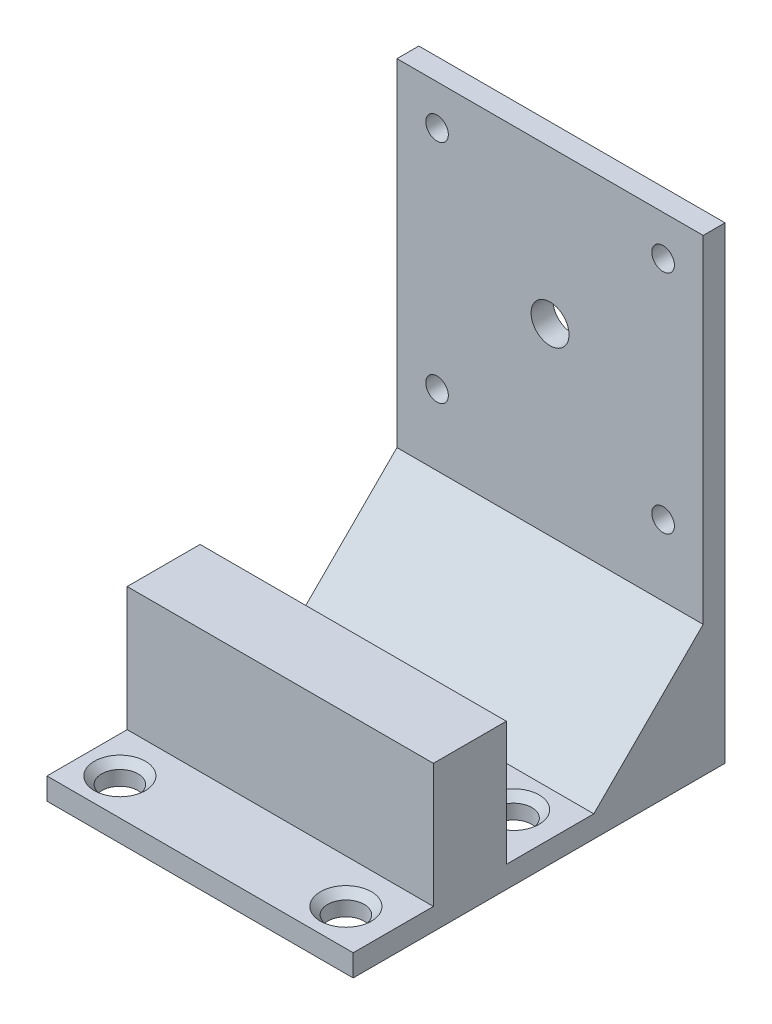
ISO-10303-21;
HEADER;
FILE_DESCRIPTION(('STEP AP214'),'2;1');
FILE_NAME('part.step','',(''),(''),'','','');
FILE_SCHEMA(('AUTOMOTIVE_DESIGN { 1 0 10303 214 1 1 1 1 }'));
ENDSEC;
DATA;
#1=APPLICATION_CONTEXT('core data for automotive mechanical design processes');
#2=APPLICATION_PROTOCOL_DEFINITION('international standard','automotive_design',2000,#1);
#3=PRODUCT_CONTEXT('',#1,'mechanical');
#4=PRODUCT('Part','Part','',(#3));
#5=PRODUCT_RELATED_PRODUCT_CATEGORY('part','',(#4));
#6=PRODUCT_DEFINITION_FORMATION('','',#4);
#7=PRODUCT_DEFINITION_CONTEXT('part definition',#1,'design');
#8=PRODUCT_DEFINITION('design','',#6,#7);
#9=PRODUCT_DEFINITION_SHAPE('','',#8);
#10=(LENGTH_UNIT() NAMED_UNIT(*) SI_UNIT(.MILLI.,.METRE.));
#11=(NAMED_UNIT(*) PLANE_ANGLE_UNIT() SI_UNIT($,.RADIAN.));
#12=(NAMED_UNIT(*) SI_UNIT($,.STERADIAN.) SOLID_ANGLE_UNIT());
#13=UNCERTAINTY_MEASURE_WITH_UNIT(LENGTH_MEASURE(1.E-05),#10,'distance_accuracy_value','');
#14=(GEOMETRIC_REPRESENTATION_CONTEXT(3) GLOBAL_UNCERTAINTY_ASSIGNED_CONTEXT((#13)) GLOBAL_UNIT_ASSIGNED_CONTEXT((#10,
#11,#12)) REPRESENTATION_CONTEXT('',''));
#15=CARTESIAN_POINT('',(0.,0.,0.));
#16=DIRECTION('',(0.,0.,1.));
#17=DIRECTION('',(1.,0.,0.));
#18=AXIS2_PLACEMENT_3D('',#15,#16,#17);
#19=CARTESIAN_POINT('',(0.,-19.2,51.));
#20=DIRECTION('',(0.,-1.,0.));
#21=DIRECTION('',(0.,0.,-1.));
#22=AXIS2_PLACEMENT_3D('',#19,#20,#21);
#23=PLANE('',#22);
#24=CARTESIAN_POINT('',(5.00000000000024,-19.2,46.0000000000001));
#25=DIRECTION('',(0.,-1.,0.));
#26=DIRECTION('',(0.,0.,-1.));
#27=AXIS2_PLACEMENT_3D('',#24,#25,#26);
#28=CIRCLE('',#27,3.5);
#29=CARTESIAN_POINT('',(5.00000000000024,-19.2,42.5000000000001));
#30=VERTEX_POINT('',#29);
#31=EDGE_CURVE('E260',#30,#30,#28,.T.);
#32=ORIENTED_EDGE('',*,*,#31,.T.);
#33=EDGE_LOOP('',(#32));
#34=FACE_BOUND('',#33,.T.);
#35=CARTESIAN_POINT('',(36.0000000000002,-19.2,46.0000000000001));
#36=DIRECTION('',(0.,-1.,0.));
#37=DIRECTION('',(0.,0.,-1.));
#38=AXIS2_PLACEMENT_3D('',#35,#36,#37);
#39=CIRCLE('',#38,3.5);
#40=CARTESIAN_POINT('',(36.0000000000002,-19.2,42.5000000000001));
#41=VERTEX_POINT('',#40);
#42=EDGE_CURVE('E263',#41,#41,#39,.T.);
#43=ORIENTED_EDGE('',*,*,#42,.T.);
#44=EDGE_LOOP('',(#43));
#45=FACE_BOUND('',#44,.T.);
#46=DIRECTION('',(1.,0.,0.));
#47=VECTOR('',#46,1.);
#48=CARTESIAN_POINT('',(0.,-19.2,40.0000000000002));
#49=LINE('',#48,#47);
#50=CARTESIAN_POINT('',(0.,-19.2,40.0000000000002));
#51=VERTEX_POINT('',#50);
#52=CARTESIAN_POINT('',(42.,-19.2,40.0000000000002));
#53=VERTEX_POINT('',#52);
#54=EDGE_CURVE('E57',#51,#53,#49,.T.);
#55=ORIENTED_EDGE('',*,*,#54,.F.);
#56=DIRECTION('',(0.,0.,-1.));
#57=VECTOR('',#56,1.);
#58=CARTESIAN_POINT('',(0.,-19.2,51.));
#59=LINE('',#58,#57);
#60=CARTESIAN_POINT('',(0.,-19.2,51.));
#61=VERTEX_POINT('',#60);
#62=EDGE_CURVE('E148',#61,#51,#59,.T.);
#63=ORIENTED_EDGE('',*,*,#62,.F.);
#64=DIRECTION('',(-1.,0.,0.));
#65=VECTOR('',#64,1.);
#66=CARTESIAN_POINT('',(0.,-19.2,51.));
#67=LINE('',#66,#65);
#68=CARTESIAN_POINT('',(42.,-19.2,51.));
#69=VERTEX_POINT('',#68);
#70=EDGE_CURVE('E186',#69,#61,#67,.T.);
#71=ORIENTED_EDGE('',*,*,#70,.F.);
#72=DIRECTION('',(0.,0.,-1.));
#73=VECTOR('',#72,1.);
#74=CARTESIAN_POINT('',(42.,-19.2,51.));
#75=LINE('',#74,#73);
#76=EDGE_CURVE('E191',#69,#53,#75,.T.);
#77=ORIENTED_EDGE('',*,*,#76,.T.);
#78=EDGE_LOOP('',(#55,#63,#71,#77));
#79=FACE_BOUND('',#78,.T.);
#80=ADVANCED_FACE('F41',(#34,#45,#79),#23,.F.);
#81=CARTESIAN_POINT('',(36.,-19.2,23.0000000000002));
#82=DIRECTION('',(0.,-1.,0.));
#83=DIRECTION('',(0.,0.,-1.));
#84=AXIS2_PLACEMENT_3D('',#81,#82,#83);
#85=CIRCLE('',#84,3.5);
#86=CARTESIAN_POINT('',(36.,-19.2,19.5000000000002));
#87=VERTEX_POINT('',#86);
#88=EDGE_CURVE('E254',#87,#87,#85,.T.);
#89=ORIENTED_EDGE('',*,*,#88,.T.);
#90=EDGE_LOOP('',(#89));
#91=FACE_BOUND('',#90,.T.);
#92=CARTESIAN_POINT('',(5.,-19.2,23.0000000000002));
#93=DIRECTION('',(0.,-1.,0.));
#94=DIRECTION('',(0.,0.,-1.));
#95=AXIS2_PLACEMENT_3D('',#92,#93,#94);
#96=CIRCLE('',#95,3.5);
#97=CARTESIAN_POINT('',(5.,-19.2,19.5000000000002));
#98=VERTEX_POINT('',#97);
#99=EDGE_CURVE('E257',#98,#98,#96,.T.);
#100=ORIENTED_EDGE('',*,*,#99,.T.);
#101=EDGE_LOOP('',(#100));
#102=FACE_BOUND('',#101,.T.);
#103=DIRECTION('',(-1.,0.,0.));
#104=VECTOR('',#103,1.);
#105=CARTESIAN_POINT('',(0.,-19.2,30.0000000000002));
#106=LINE('',#105,#104);
#107=CARTESIAN_POINT('',(42.,-19.2,30.0000000000002));
#108=VERTEX_POINT('',#107);
#109=CARTESIAN_POINT('',(0.,-19.2,30.0000000000002));
#110=VERTEX_POINT('',#109);
#111=EDGE_CURVE('E65',#108,#110,#106,.T.);
#112=ORIENTED_EDGE('',*,*,#111,.F.);
#113=CARTESIAN_POINT('',(42.,-19.2,18.0000000000002));
#114=VERTEX_POINT('',#113);
#115=EDGE_CURVE('E190',#108,#114,#75,.T.);
#116=ORIENTED_EDGE('',*,*,#115,.T.);
#117=DIRECTION('',(1.,0.,0.));
#118=VECTOR('',#117,1.);
#119=CARTESIAN_POINT('',(-21.2132034355965,-19.2,18.0000000000002));
#120=LINE('',#119,#118);
#121=CARTESIAN_POINT('',(0.,-19.2,18.0000000000002));
#122=VERTEX_POINT('',#121);
#123=EDGE_CURVE('E172',#122,#114,#120,.T.);
#124=ORIENTED_EDGE('',*,*,#123,.F.);
#125=EDGE_CURVE('E188',#110,#122,#59,.T.);
#126=ORIENTED_EDGE('',*,*,#125,.F.);
#127=EDGE_LOOP('',(#112,#116,#124,#126));
#128=FACE_BOUND('',#127,.T.);
#129=ADVANCED_FACE('F289',(#91,#102,#128),#23,.F.);
#130=CARTESIAN_POINT('',(0.,0.,3.));
#131=DIRECTION('',(-1.,0.,0.));
#132=DIRECTION('',(0.,0.,1.));
#133=AXIS2_PLACEMENT_3D('',#130,#131,#132);
#134=PLANE('',#133);
#135=DIRECTION('',(0.,-0.707106781186544,0.707106781186551));
#136=VECTOR('',#135,1.);
#137=CARTESIAN_POINT('',(0.,-4.2,3.));
#138=LINE('',#137,#136);
#139=CARTESIAN_POINT('',(0.,-4.2,3.));
#140=VERTEX_POINT('',#139);
#141=EDGE_CURVE('E169',#140,#122,#138,.T.);
#142=ORIENTED_EDGE('',*,*,#141,.F.);
#143=DIRECTION('',(0.,1.,0.));
#144=VECTOR('',#143,1.);
#145=CARTESIAN_POINT('',(0.,0.,3.));
#146=LINE('',#145,#144);
#147=CARTESIAN_POINT('',(0.,42.,3.));
#148=VERTEX_POINT('',#147);
#149=EDGE_CURVE('E210',#140,#148,#146,.T.);
#150=ORIENTED_EDGE('',*,*,#149,.T.);
#151=DIRECTION('',(0.,0.,-1.));
#152=VECTOR('',#151,1.);
#153=CARTESIAN_POINT('',(0.,42.,3.));
#154=LINE('',#153,#152);
#155=CARTESIAN_POINT('',(0.,42.,0.));
#156=VERTEX_POINT('',#155);
#157=EDGE_CURVE('E217',#148,#156,#154,.T.);
#158=ORIENTED_EDGE('',*,*,#157,.T.);
#159=DIRECTION('',(0.,1.,0.));
#160=VECTOR('',#159,1.);
#161=CARTESIAN_POINT('',(0.,0.,0.));
#162=LINE('',#161,#160);
#163=CARTESIAN_POINT('',(0.,-22.2,0.));
#164=VERTEX_POINT('',#163);
#165=EDGE_CURVE('E232',#164,#156,#162,.T.);
#166=ORIENTED_EDGE('',*,*,#165,.F.);
#167=DIRECTION('',(0.,0.,-1.));
#168=VECTOR('',#167,1.);
#169=CARTESIAN_POINT('',(0.,-22.2,3.));
#170=LINE('',#169,#168);
#171=CARTESIAN_POINT('',(0.,-22.2,51.));
#172=VERTEX_POINT('',#171);
#173=EDGE_CURVE('E249',#172,#164,#170,.T.);
#174=ORIENTED_EDGE('',*,*,#173,.F.);
#175=DIRECTION('',(0.,-1.,0.));
#176=VECTOR('',#175,1.);
#177=CARTESIAN_POINT('',(0.,-22.2,51.));
#178=LINE('',#177,#176);
#179=EDGE_CURVE('E178',#61,#172,#178,.T.);
#180=ORIENTED_EDGE('',*,*,#179,.F.);
#181=ORIENTED_EDGE('',*,*,#62,.T.);
#182=DIRECTION('',(0.,-1.,0.));
#183=VECTOR('',#182,1.);
#184=CARTESIAN_POINT('',(0.,-2.2,40.0000000000002));
#185=LINE('',#184,#183);
#186=CARTESIAN_POINT('',(0.,-2.2,40.0000000000002));
#187=VERTEX_POINT('',#186);
#188=EDGE_CURVE('E130',#187,#51,#185,.T.);
#189=ORIENTED_EDGE('',*,*,#188,.F.);
#190=DIRECTION('',(0.,0.,1.));
#191=VECTOR('',#190,1.);
#192=CARTESIAN_POINT('',(0.,-2.2,30.0000000000002));
#193=LINE('',#192,#191);
#194=CARTESIAN_POINT('',(0.,-2.2,30.0000000000002));
#195=VERTEX_POINT('',#194);
#196=EDGE_CURVE('E136',#195,#187,#193,.T.);
#197=ORIENTED_EDGE('',*,*,#196,.F.);
#198=DIRECTION('',(0.,-1.,0.));
#199=VECTOR('',#198,1.);
#200=CARTESIAN_POINT('',(0.,-2.2,30.0000000000002));
#201=LINE('',#200,#199);
#202=EDGE_CURVE('E398',#195,#110,#201,.T.);
#203=ORIENTED_EDGE('',*,*,#202,.T.);
#204=ORIENTED_EDGE('',*,*,#125,.T.);
#205=EDGE_LOOP('',(#142,#150,#158,#166,#174,#180,#181,#189,#197,#203,#204));
#206=FACE_BOUND('',#205,.T.);
#207=ADVANCED_FACE('F146',(#206),#134,.T.);
#208=CARTESIAN_POINT('',(0.,-22.2,3.));
#209=DIRECTION('',(0.,1.,0.));
#210=DIRECTION('',(-1.,0.,0.));
#211=AXIS2_PLACEMENT_3D('',#208,#209,#210);
#212=PLANE('',#211);
#213=CARTESIAN_POINT('',(5.00000000000024,-22.2,46.0000000000001));
#214=DIRECTION('',(0.,1.,0.));
#215=DIRECTION('',(-1.,0.,0.));
#216=AXIS2_PLACEMENT_3D('',#213,#214,#215);
#217=CIRCLE('',#216,2.5);
#218=CARTESIAN_POINT('',(2.50000000000024,-22.2,46.0000000000001));
#219=VERTEX_POINT('',#218);
#220=EDGE_CURVE('E149',#219,#219,#217,.F.);
#221=ORIENTED_EDGE('',*,*,#220,.F.);
#222=EDGE_LOOP('',(#221));
#223=FACE_BOUND('',#222,.T.);
#224=CARTESIAN_POINT('',(36.0000000000002,-22.2,46.0000000000001));
#225=DIRECTION('',(0.,1.,0.));
#226=DIRECTION('',(-1.,0.,0.));
#227=AXIS2_PLACEMENT_3D('',#224,#225,#226);
#228=CIRCLE('',#227,2.5);
#229=CARTESIAN_POINT('',(33.5000000000002,-22.2,46.0000000000001));
#230=VERTEX_POINT('',#229);
#231=EDGE_CURVE('E152',#230,#230,#228,.F.);
#232=ORIENTED_EDGE('',*,*,#231,.F.);
#233=EDGE_LOOP('',(#232));
#234=FACE_BOUND('',#233,.T.);
#235=CARTESIAN_POINT('',(36.,-22.2,23.0000000000002));
#236=DIRECTION('',(0.,1.,0.));
#237=DIRECTION('',(-1.,0.,0.));
#238=AXIS2_PLACEMENT_3D('',#235,#236,#237);
#239=CIRCLE('',#238,2.5);
#240=CARTESIAN_POINT('',(33.5,-22.2,23.0000000000002));
#241=VERTEX_POINT('',#240);
#242=EDGE_CURVE('E158',#241,#241,#239,.F.);
#243=ORIENTED_EDGE('',*,*,#242,.F.);
#244=EDGE_LOOP('',(#243));
#245=FACE_BOUND('',#244,.T.);
#246=CARTESIAN_POINT('',(5.,-22.2,23.0000000000002));
#247=DIRECTION('',(0.,1.,0.));
#248=DIRECTION('',(-1.,0.,0.));
#249=AXIS2_PLACEMENT_3D('',#246,#247,#248);
#250=CIRCLE('',#249,2.5);
#251=CARTESIAN_POINT('',(2.5,-22.2,23.0000000000002));
#252=VERTEX_POINT('',#251);
#253=EDGE_CURVE('E161',#252,#252,#250,.F.);
#254=ORIENTED_EDGE('',*,*,#253,.F.);
#255=EDGE_LOOP('',(#254));
#256=FACE_BOUND('',#255,.T.);
#257=DIRECTION('',(1.,0.,0.));
#258=VECTOR('',#257,1.);
#259=CARTESIAN_POINT('',(0.,-22.2,0.));
#260=LINE('',#259,#258);
#261=CARTESIAN_POINT('',(42.,-22.2,0.));
#262=VERTEX_POINT('',#261);
#263=EDGE_CURVE('E235',#164,#262,#260,.T.);
#264=ORIENTED_EDGE('',*,*,#263,.T.);
#265=DIRECTION('',(0.,0.,-1.));
#266=VECTOR('',#265,1.);
#267=CARTESIAN_POINT('',(42.,-22.2,3.));
#268=LINE('',#267,#266);
#269=CARTESIAN_POINT('',(42.,-22.2,51.));
#270=VERTEX_POINT('',#269);
#271=EDGE_CURVE('E246',#270,#262,#268,.T.);
#272=ORIENTED_EDGE('',*,*,#271,.F.);
#273=DIRECTION('',(1.,0.,0.));
#274=VECTOR('',#273,1.);
#275=CARTESIAN_POINT('',(0.,-22.2,51.));
#276=LINE('',#275,#274);
#277=EDGE_CURVE('E181',#172,#270,#276,.T.);
#278=ORIENTED_EDGE('',*,*,#277,.F.);
#279=ORIENTED_EDGE('',*,*,#173,.T.);
#280=EDGE_LOOP('',(#264,#272,#278,#279));
#281=FACE_BOUND('',#280,.T.);
#282=ADVANCED_FACE('F319',(#223,#234,#245,#256,#281),#212,.F.);
#283=CARTESIAN_POINT('',(42.,0.,3.));
#284=DIRECTION('',(-1.,0.,0.));
#285=DIRECTION('',(0.,0.,1.));
#286=AXIS2_PLACEMENT_3D('',#283,#284,#285);
#287=PLANE('',#286);
#288=DIRECTION('',(0.,1.,0.));
#289=VECTOR('',#288,1.);
#290=CARTESIAN_POINT('',(42.,0.,3.));
#291=LINE('',#290,#289);
#292=CARTESIAN_POINT('',(42.,-4.2,3.));
#293=VERTEX_POINT('',#292);
#294=CARTESIAN_POINT('',(42.,42.,3.));
#295=VERTEX_POINT('',#294);
#296=EDGE_CURVE('E212',#293,#295,#291,.T.);
#297=ORIENTED_EDGE('',*,*,#296,.F.);
#298=DIRECTION('',(0.,-0.707106781186544,0.707106781186551));
#299=VECTOR('',#298,1.);
#300=CARTESIAN_POINT('',(42.,-4.2,3.));
#301=LINE('',#300,#299);
#302=EDGE_CURVE('E166',#293,#114,#301,.T.);
#303=ORIENTED_EDGE('',*,*,#302,.T.);
#304=ORIENTED_EDGE('',*,*,#115,.F.);
#305=DIRECTION('',(0.,-1.,0.));
#306=VECTOR('',#305,1.);
#307=CARTESIAN_POINT('',(42.,-2.2,30.0000000000002));
#308=LINE('',#307,#306);
#309=CARTESIAN_POINT('',(42.,-2.2,30.0000000000002));
#310=VERTEX_POINT('',#309);
#311=EDGE_CURVE('E154',#310,#108,#308,.T.);
#312=ORIENTED_EDGE('',*,*,#311,.F.);
#313=DIRECTION('',(0.,0.,-1.));
#314=VECTOR('',#313,1.);
#315=CARTESIAN_POINT('',(42.,-2.2,30.0000000000002));
#316=LINE('',#315,#314);
#317=CARTESIAN_POINT('',(42.,-2.2,40.0000000000002));
#318=VERTEX_POINT('',#317);
#319=EDGE_CURVE('E135',#318,#310,#316,.T.);
#320=ORIENTED_EDGE('',*,*,#319,.F.);
#321=DIRECTION('',(0.,-1.,0.));
#322=VECTOR('',#321,1.);
#323=CARTESIAN_POINT('',(42.,-2.2,40.0000000000002));
#324=LINE('',#323,#322);
#325=EDGE_CURVE('E132',#318,#53,#324,.T.);
#326=ORIENTED_EDGE('',*,*,#325,.T.);
#327=ORIENTED_EDGE('',*,*,#76,.F.);
#328=DIRECTION('',(0.,1.,0.));
#329=VECTOR('',#328,1.);
#330=CARTESIAN_POINT('',(42.,-22.2,51.));
#331=LINE('',#330,#329);
#332=EDGE_CURVE('E184',#270,#69,#331,.T.);
#333=ORIENTED_EDGE('',*,*,#332,.F.);
#334=ORIENTED_EDGE('',*,*,#271,.T.);
#335=DIRECTION('',(0.,1.,0.));
#336=VECTOR('',#335,1.);
#337=CARTESIAN_POINT('',(42.,0.,0.));
#338=LINE('',#337,#336);
#339=CARTESIAN_POINT('',(42.,42.,0.));
#340=VERTEX_POINT('',#339);
#341=EDGE_CURVE('E238',#262,#340,#338,.T.);
#342=ORIENTED_EDGE('',*,*,#341,.T.);
#343=DIRECTION('',(0.,0.,-1.));
#344=VECTOR('',#343,1.);
#345=CARTESIAN_POINT('',(42.,42.,3.));
#346=LINE('',#345,#344);
#347=EDGE_CURVE('E244',#295,#340,#346,.T.);
#348=ORIENTED_EDGE('',*,*,#347,.F.);
#349=EDGE_LOOP('',(#297,#303,#304,#312,#320,#326,#327,#333,#334,#342,#348));
#350=FACE_BOUND('',#349,.T.);
#351=ADVANCED_FACE('F315',(#350),#287,.F.);
#352=CARTESIAN_POINT('',(5.5,5.5,3.));
#353=DIRECTION('',(0.,0.,-1.));
#354=DIRECTION('',(-1.,0.,0.));
#355=AXIS2_PLACEMENT_3D('',#352,#353,#354);
#356=CYLINDRICAL_SURFACE('',#355,1.55);
#357=CARTESIAN_POINT('',(5.5,5.5,3.));
#358=DIRECTION('',(0.,0.,1.));
#359=DIRECTION('',(1.,0.,0.));
#360=AXIS2_PLACEMENT_3D('',#357,#358,#359);
#361=CIRCLE('',#360,1.55);
#362=CARTESIAN_POINT('',(7.05,5.5,3.));
#363=VERTEX_POINT('',#362);
#364=EDGE_CURVE('E207',#363,#363,#361,.T.);
#365=ORIENTED_EDGE('',*,*,#364,.T.);
#366=EDGE_LOOP('',(#365));
#367=FACE_BOUND('',#366,.T.);
#368=CARTESIAN_POINT('',(5.5,5.5,0.));
#369=DIRECTION('',(0.,0.,1.));
#370=DIRECTION('',(1.,0.,0.));
#371=AXIS2_PLACEMENT_3D('',#368,#369,#370);
#372=CIRCLE('',#371,1.55);
#373=CARTESIAN_POINT('',(7.05,5.5,0.));
#374=VERTEX_POINT('',#373);
#375=EDGE_CURVE('E229',#374,#374,#372,.T.);
#376=ORIENTED_EDGE('',*,*,#375,.F.);
#377=EDGE_LOOP('',(#376));
#378=FACE_BOUND('',#377,.T.);
#379=ADVANCED_FACE('F318',(#367,#378),#356,.F.);
#380=CARTESIAN_POINT('',(36.5,5.5,3.));
#381=DIRECTION('',(0.,0.,-1.));
#382=DIRECTION('',(-1.,0.,0.));
#383=AXIS2_PLACEMENT_3D('',#380,#381,#382);
#384=CYLINDRICAL_SURFACE('',#383,1.55);
#385=CARTESIAN_POINT('',(36.5,5.5,3.));
#386=DIRECTION('',(0.,0.,1.));
#387=DIRECTION('',(1.,0.,0.));
#388=AXIS2_PLACEMENT_3D('',#385,#386,#387);
#389=CIRCLE('',#388,1.55);
#390=CARTESIAN_POINT('',(38.05,5.5,3.));
#391=VERTEX_POINT('',#390);
#392=EDGE_CURVE('E204',#391,#391,#389,.T.);
#393=ORIENTED_EDGE('',*,*,#392,.T.);
#394=EDGE_LOOP('',(#393));
#395=FACE_BOUND('',#394,.T.);
#396=CARTESIAN_POINT('',(36.5,5.5,0.));
#397=DIRECTION('',(0.,0.,1.));
#398=DIRECTION('',(1.,0.,0.));
#399=AXIS2_PLACEMENT_3D('',#396,#397,#398);
#400=CIRCLE('',#399,1.55);
#401=CARTESIAN_POINT('',(38.05,5.5,0.));
#402=VERTEX_POINT('',#401);
#403=EDGE_CURVE('E226',#402,#402,#400,.T.);
#404=ORIENTED_EDGE('',*,*,#403,.F.);
#405=EDGE_LOOP('',(#404));
#406=FACE_BOUND('',#405,.T.);
#407=ADVANCED_FACE('F328',(#395,#406),#384,.F.);
#408=CARTESIAN_POINT('',(36.4999999999999,36.5,3.));
#409=DIRECTION('',(0.,0.,-1.));
#410=DIRECTION('',(-1.,0.,0.));
#411=AXIS2_PLACEMENT_3D('',#408,#409,#410);
#412=CYLINDRICAL_SURFACE('',#411,1.55);
#413=CARTESIAN_POINT('',(36.4999999999999,36.5,3.));
#414=DIRECTION('',(0.,0.,1.));
#415=DIRECTION('',(1.,0.,0.));
#416=AXIS2_PLACEMENT_3D('',#413,#414,#415);
#417=CIRCLE('',#416,1.55);
#418=CARTESIAN_POINT('',(38.0499999999999,36.5,3.));
#419=VERTEX_POINT('',#418);
#420=EDGE_CURVE('E201',#419,#419,#417,.T.);
#421=ORIENTED_EDGE('',*,*,#420,.T.);
#422=EDGE_LOOP('',(#421));
#423=FACE_BOUND('',#422,.T.);
#424=CARTESIAN_POINT('',(36.4999999999999,36.5,0.));
#425=DIRECTION('',(0.,0.,1.));
#426=DIRECTION('',(1.,0.,0.));
#427=AXIS2_PLACEMENT_3D('',#424,#425,#426);
#428=CIRCLE('',#427,1.55);
#429=CARTESIAN_POINT('',(38.0499999999999,36.5,0.));
#430=VERTEX_POINT('',#429);
#431=EDGE_CURVE('E223',#430,#430,#428,.T.);
#432=ORIENTED_EDGE('',*,*,#431,.F.);
#433=EDGE_LOOP('',(#432));
#434=FACE_BOUND('',#433,.T.);
#435=ADVANCED_FACE('F332',(#423,#434),#412,.F.);
#436=CARTESIAN_POINT('',(5.49999999999989,36.5,3.));
#437=DIRECTION('',(0.,0.,-1.));
#438=DIRECTION('',(-1.,0.,0.));
#439=AXIS2_PLACEMENT_3D('',#436,#437,#438);
#440=CYLINDRICAL_SURFACE('',#439,1.55);
#441=CARTESIAN_POINT('',(5.49999999999989,36.5,3.));
#442=DIRECTION('',(0.,0.,1.));
#443=DIRECTION('',(1.,0.,0.));
#444=AXIS2_PLACEMENT_3D('',#441,#442,#443);
#445=CIRCLE('',#444,1.55);
#446=CARTESIAN_POINT('',(7.04999999999989,36.5,3.));
#447=VERTEX_POINT('',#446);
#448=EDGE_CURVE('E197',#447,#447,#445,.T.);
#449=ORIENTED_EDGE('',*,*,#448,.T.);
#450=EDGE_LOOP('',(#449));
#451=FACE_BOUND('',#450,.T.);
#452=CARTESIAN_POINT('',(5.49999999999989,36.5,0.));
#453=DIRECTION('',(0.,0.,1.));
#454=DIRECTION('',(1.,0.,0.));
#455=AXIS2_PLACEMENT_3D('',#452,#453,#454);
#456=CIRCLE('',#455,1.55);
#457=CARTESIAN_POINT('',(7.04999999999989,36.5,0.));
#458=VERTEX_POINT('',#457);
#459=EDGE_CURVE('E220',#458,#458,#456,.T.);
#460=ORIENTED_EDGE('',*,*,#459,.F.);
#461=EDGE_LOOP('',(#460));
#462=FACE_BOUND('',#461,.T.);
#463=ADVANCED_FACE('F336',(#451,#462),#440,.F.);
#464=CARTESIAN_POINT('',(21.,21.,3.));
#465=DIRECTION('',(0.,0.,-1.));
#466=DIRECTION('',(-1.,0.,0.));
#467=AXIS2_PLACEMENT_3D('',#464,#465,#466);
#468=CYLINDRICAL_SURFACE('',#467,2.6);
#469=CARTESIAN_POINT('',(21.,21.,3.));
#470=DIRECTION('',(0.,0.,1.));
#471=DIRECTION('',(1.,0.,0.));
#472=AXIS2_PLACEMENT_3D('',#469,#470,#471);
#473=CIRCLE('',#472,2.6);
#474=CARTESIAN_POINT('',(23.6,21.,3.));
#475=VERTEX_POINT('',#474);
#476=EDGE_CURVE('E194',#475,#475,#473,.T.);
#477=ORIENTED_EDGE('',*,*,#476,.T.);
#478=EDGE_LOOP('',(#477));
#479=FACE_BOUND('',#478,.T.);
#480=CARTESIAN_POINT('',(21.,21.,0.));
#481=DIRECTION('',(0.,0.,1.));
#482=DIRECTION('',(1.,0.,0.));
#483=AXIS2_PLACEMENT_3D('',#480,#481,#482);
#484=CIRCLE('',#483,2.6);
#485=CARTESIAN_POINT('',(23.6,21.,0.));
#486=VERTEX_POINT('',#485);
#487=EDGE_CURVE('E193',#486,#486,#484,.T.);
#488=ORIENTED_EDGE('',*,*,#487,.F.);
#489=EDGE_LOOP('',(#488));
#490=FACE_BOUND('',#489,.T.);
#491=ADVANCED_FACE('F313',(#479,#490),#468,.F.);
#492=CARTESIAN_POINT('',(0.,42.,3.));
#493=DIRECTION('',(0.,1.,0.));
#494=DIRECTION('',(0.,0.,1.));
#495=AXIS2_PLACEMENT_3D('',#492,#493,#494);
#496=PLANE('',#495);
#497=DIRECTION('',(1.,0.,0.));
#498=VECTOR('',#497,1.);
#499=CARTESIAN_POINT('',(0.,42.,0.));
#500=LINE('',#499,#498);
#501=EDGE_CURVE('E198',#156,#340,#500,.T.);
#502=ORIENTED_EDGE('',*,*,#501,.F.);
#503=ORIENTED_EDGE('',*,*,#157,.F.);
#504=DIRECTION('',(1.,0.,0.));
#505=VECTOR('',#504,1.);
#506=CARTESIAN_POINT('',(0.,42.,3.));
#507=LINE('',#506,#505);
#508=EDGE_CURVE('E214',#148,#295,#507,.T.);
#509=ORIENTED_EDGE('',*,*,#508,.T.);
#510=ORIENTED_EDGE('',*,*,#347,.T.);
#511=EDGE_LOOP('',(#502,#503,#509,#510));
#512=FACE_BOUND('',#511,.T.);
#513=ADVANCED_FACE('F306',(#512),#496,.T.);
#514=CARTESIAN_POINT('',(0.,0.,3.));
#515=DIRECTION('',(0.,0.,1.));
#516=DIRECTION('',(1.,0.,0.));
#517=AXIS2_PLACEMENT_3D('',#514,#515,#516);
#518=PLANE('',#517);
#519=DIRECTION('',(1.,0.,0.));
#520=VECTOR('',#519,1.);
#521=CARTESIAN_POINT('',(-21.2132034355965,-4.2,3.));
#522=LINE('',#521,#520);
#523=EDGE_CURVE('E175',#140,#293,#522,.T.);
#524=ORIENTED_EDGE('',*,*,#523,.T.);
#525=ORIENTED_EDGE('',*,*,#296,.T.);
#526=ORIENTED_EDGE('',*,*,#508,.F.);
#527=ORIENTED_EDGE('',*,*,#149,.F.);
#528=EDGE_LOOP('',(#524,#525,#526,#527));
#529=FACE_BOUND('',#528,.T.);
#530=ORIENTED_EDGE('',*,*,#476,.F.);
#531=EDGE_LOOP('',(#530));
#532=FACE_BOUND('',#531,.T.);
#533=ORIENTED_EDGE('',*,*,#448,.F.);
#534=EDGE_LOOP('',(#533));
#535=FACE_BOUND('',#534,.T.);
#536=ORIENTED_EDGE('',*,*,#420,.F.);
#537=EDGE_LOOP('',(#536));
#538=FACE_BOUND('',#537,.T.);
#539=ORIENTED_EDGE('',*,*,#392,.F.);
#540=EDGE_LOOP('',(#539));
#541=FACE_BOUND('',#540,.T.);
#542=ORIENTED_EDGE('',*,*,#364,.F.);
#543=EDGE_LOOP('',(#542));
#544=FACE_BOUND('',#543,.T.);
#545=ADVANCED_FACE('F302',(#529,#532,#535,#538,#541,#544),#518,.T.);
#546=CARTESIAN_POINT('',(0.,0.,0.));
#547=DIRECTION('',(0.,0.,1.));
#548=DIRECTION('',(1.,0.,0.));
#549=AXIS2_PLACEMENT_3D('',#546,#547,#548);
#550=PLANE('',#549);
#551=ORIENTED_EDGE('',*,*,#487,.T.);
#552=EDGE_LOOP('',(#551));
#553=FACE_BOUND('',#552,.T.);
#554=ORIENTED_EDGE('',*,*,#459,.T.);
#555=EDGE_LOOP('',(#554));
#556=FACE_BOUND('',#555,.T.);
#557=ORIENTED_EDGE('',*,*,#431,.T.);
#558=EDGE_LOOP('',(#557));
#559=FACE_BOUND('',#558,.T.);
#560=ORIENTED_EDGE('',*,*,#403,.T.);
#561=EDGE_LOOP('',(#560));
#562=FACE_BOUND('',#561,.T.);
#563=ORIENTED_EDGE('',*,*,#375,.T.);
#564=EDGE_LOOP('',(#563));
#565=FACE_BOUND('',#564,.T.);
#566=ORIENTED_EDGE('',*,*,#165,.T.);
#567=ORIENTED_EDGE('',*,*,#501,.T.);
#568=ORIENTED_EDGE('',*,*,#341,.F.);
#569=ORIENTED_EDGE('',*,*,#263,.F.);
#570=EDGE_LOOP('',(#566,#567,#568,#569));
#571=FACE_BOUND('',#570,.T.);
#572=ADVANCED_FACE('F305',(#553,#556,#559,#562,#565,#571),#550,.F.);
#573=CARTESIAN_POINT('',(0.,0.,51.));
#574=DIRECTION('',(0.,0.,-1.));
#575=DIRECTION('',(-1.,0.,0.));
#576=AXIS2_PLACEMENT_3D('',#573,#574,#575);
#577=PLANE('',#576);
#578=ORIENTED_EDGE('',*,*,#179,.T.);
#579=ORIENTED_EDGE('',*,*,#277,.T.);
#580=ORIENTED_EDGE('',*,*,#332,.T.);
#581=ORIENTED_EDGE('',*,*,#70,.T.);
#582=EDGE_LOOP('',(#578,#579,#580,#581));
#583=FACE_BOUND('',#582,.T.);
#584=ADVANCED_FACE('F300',(#583),#577,.F.);
#585=CARTESIAN_POINT('',(-21.2132034355965,-4.2,3.));
#586=DIRECTION('',(0.,0.707106781186551,0.707106781186544));
#587=DIRECTION('',(0.,-0.707106781186544,0.707106781186551));
#588=AXIS2_PLACEMENT_3D('',#585,#586,#587);
#589=PLANE('',#588);
#590=ORIENTED_EDGE('',*,*,#523,.F.);
#591=ORIENTED_EDGE('',*,*,#141,.T.);
#592=ORIENTED_EDGE('',*,*,#123,.T.);
#593=ORIENTED_EDGE('',*,*,#302,.F.);
#594=EDGE_LOOP('',(#590,#591,#592,#593));
#595=FACE_BOUND('',#594,.T.);
#596=ADVANCED_FACE('F406',(#595),#589,.T.);
#597=CARTESIAN_POINT('',(5.,-22.201,23.0000000000002));
#598=DIRECTION('',(0.,1.,0.));
#599=DIRECTION('',(0.,0.,1.));
#600=AXIS2_PLACEMENT_3D('',#597,#598,#599);
#601=CYLINDRICAL_SURFACE('',#600,2.5);
#602=CARTESIAN_POINT('',(5.,-20.2,23.0000000000002));
#603=DIRECTION('',(0.,-1.,0.));
#604=DIRECTION('',(0.,0.,-1.));
#605=AXIS2_PLACEMENT_3D('',#602,#603,#604);
#606=CIRCLE('',#605,2.5);
#607=CARTESIAN_POINT('',(5.,-20.2,20.5000000000002));
#608=VERTEX_POINT('',#607);
#609=EDGE_CURVE('E50',#608,#608,#606,.F.);
#610=ORIENTED_EDGE('',*,*,#609,.T.);
#611=EDGE_LOOP('',(#610));
#612=FACE_BOUND('',#611,.T.);
#613=ORIENTED_EDGE('',*,*,#253,.T.);
#614=EDGE_LOOP('',(#613));
#615=FACE_BOUND('',#614,.T.);
#616=ADVANCED_FACE('F271',(#612,#615),#601,.F.);
#617=CARTESIAN_POINT('',(36.,-22.201,23.0000000000002));
#618=DIRECTION('',(0.,1.,0.));
#619=DIRECTION('',(0.,0.,1.));
#620=AXIS2_PLACEMENT_3D('',#617,#618,#619);
#621=CYLINDRICAL_SURFACE('',#620,2.5);
#622=CARTESIAN_POINT('',(36.,-20.2,23.0000000000002));
#623=DIRECTION('',(0.,-1.,0.));
#624=DIRECTION('',(0.,0.,-1.));
#625=AXIS2_PLACEMENT_3D('',#622,#623,#624);
#626=CIRCLE('',#625,2.5);
#627=CARTESIAN_POINT('',(36.,-20.2,20.5000000000002));
#628=VERTEX_POINT('',#627);
#629=EDGE_CURVE('E11',#628,#628,#626,.F.);
#630=ORIENTED_EDGE('',*,*,#629,.T.);
#631=EDGE_LOOP('',(#630));
#632=FACE_BOUND('',#631,.T.);
#633=ORIENTED_EDGE('',*,*,#242,.T.);
#634=EDGE_LOOP('',(#633));
#635=FACE_BOUND('',#634,.T.);
#636=ADVANCED_FACE('F369',(#632,#635),#621,.F.);
#637=CARTESIAN_POINT('',(36.0000000000002,-22.201,46.0000000000001));
#638=DIRECTION('',(0.,1.,0.));
#639=DIRECTION('',(0.,0.,1.));
#640=AXIS2_PLACEMENT_3D('',#637,#638,#639);
#641=CYLINDRICAL_SURFACE('',#640,2.5);
#642=CARTESIAN_POINT('',(36.0000000000002,-20.2,46.0000000000001));
#643=DIRECTION('',(0.,-1.,0.));
#644=DIRECTION('',(0.,0.,-1.));
#645=AXIS2_PLACEMENT_3D('',#642,#643,#644);
#646=CIRCLE('',#645,2.5);
#647=CARTESIAN_POINT('',(36.0000000000002,-20.2,43.5000000000002));
#648=VERTEX_POINT('',#647);
#649=EDGE_CURVE('E251',#648,#648,#646,.F.);
#650=ORIENTED_EDGE('',*,*,#649,.T.);
#651=EDGE_LOOP('',(#650));
#652=FACE_BOUND('',#651,.T.);
#653=ORIENTED_EDGE('',*,*,#231,.T.);
#654=EDGE_LOOP('',(#653));
#655=FACE_BOUND('',#654,.T.);
#656=ADVANCED_FACE('F360',(#652,#655),#641,.F.);
#657=CARTESIAN_POINT('',(5.00000000000024,-22.201,46.0000000000001));
#658=DIRECTION('',(0.,1.,0.));
#659=DIRECTION('',(0.,0.,1.));
#660=AXIS2_PLACEMENT_3D('',#657,#658,#659);
#661=CYLINDRICAL_SURFACE('',#660,2.5);
#662=CARTESIAN_POINT('',(5.00000000000024,-20.2,46.0000000000001));
#663=DIRECTION('',(0.,-1.,0.));
#664=DIRECTION('',(0.,0.,-1.));
#665=AXIS2_PLACEMENT_3D('',#662,#663,#664);
#666=CIRCLE('',#665,2.5);
#667=CARTESIAN_POINT('',(5.00000000000024,-20.2,43.5000000000002));
#668=VERTEX_POINT('',#667);
#669=EDGE_CURVE('E266',#668,#668,#666,.F.);
#670=ORIENTED_EDGE('',*,*,#669,.T.);
#671=EDGE_LOOP('',(#670));
#672=FACE_BOUND('',#671,.T.);
#673=ORIENTED_EDGE('',*,*,#220,.T.);
#674=EDGE_LOOP('',(#673));
#675=FACE_BOUND('',#674,.T.);
#676=ADVANCED_FACE('F349',(#672,#675),#661,.F.);
#677=CARTESIAN_POINT('',(36.0000000000002,-20.2,46.0000000000001));
#678=DIRECTION('',(0.,1.,0.));
#679=DIRECTION('',(0.,0.,1.));
#680=AXIS2_PLACEMENT_3D('',#677,#678,#679);
#681=CONICAL_SURFACE('',#680,2.5,0.785398163397451);
#682=ORIENTED_EDGE('',*,*,#42,.F.);
#683=EDGE_LOOP('',(#682));
#684=FACE_BOUND('',#683,.T.);
#685=ORIENTED_EDGE('',*,*,#649,.F.);
#686=EDGE_LOOP('',(#685));
#687=FACE_BOUND('',#686,.T.);
#688=ADVANCED_FACE('F283',(#684,#687),#681,.F.);
#689=CARTESIAN_POINT('',(5.00000000000024,-20.2,46.0000000000001));
#690=DIRECTION('',(0.,1.,0.));
#691=DIRECTION('',(0.,0.,1.));
#692=AXIS2_PLACEMENT_3D('',#689,#690,#691);
#693=CONICAL_SURFACE('',#692,2.5,0.78539816339745);
#694=ORIENTED_EDGE('',*,*,#31,.F.);
#695=EDGE_LOOP('',(#694));
#696=FACE_BOUND('',#695,.T.);
#697=ORIENTED_EDGE('',*,*,#669,.F.);
#698=EDGE_LOOP('',(#697));
#699=FACE_BOUND('',#698,.T.);
#700=ADVANCED_FACE('F276',(#696,#699),#693,.F.);
#701=CARTESIAN_POINT('',(5.,-20.2,23.0000000000002));
#702=DIRECTION('',(0.,1.,0.));
#703=DIRECTION('',(0.,0.,1.));
#704=AXIS2_PLACEMENT_3D('',#701,#702,#703);
#705=CONICAL_SURFACE('',#704,2.5,0.785398163397452);
#706=ORIENTED_EDGE('',*,*,#99,.F.);
#707=EDGE_LOOP('',(#706));
#708=FACE_BOUND('',#707,.T.);
#709=ORIENTED_EDGE('',*,*,#609,.F.);
#710=EDGE_LOOP('',(#709));
#711=FACE_BOUND('',#710,.T.);
#712=ADVANCED_FACE('F274',(#708,#711),#705,.F.);
#713=CARTESIAN_POINT('',(36.,-20.2,23.0000000000002));
#714=DIRECTION('',(0.,1.,0.));
#715=DIRECTION('',(0.,0.,1.));
#716=AXIS2_PLACEMENT_3D('',#713,#714,#715);
#717=CONICAL_SURFACE('',#716,2.5,0.785398163397451);
#718=ORIENTED_EDGE('',*,*,#88,.F.);
#719=EDGE_LOOP('',(#718));
#720=FACE_BOUND('',#719,.T.);
#721=ORIENTED_EDGE('',*,*,#629,.F.);
#722=EDGE_LOOP('',(#721));
#723=FACE_BOUND('',#722,.T.);
#724=ADVANCED_FACE('F44',(#720,#723),#717,.F.);
#725=CARTESIAN_POINT('',(0.,-2.2,40.0000000000002));
#726=DIRECTION('',(0.,0.,-1.));
#727=DIRECTION('',(-1.,0.,0.));
#728=AXIS2_PLACEMENT_3D('',#725,#726,#727);
#729=PLANE('',#728);
#730=ORIENTED_EDGE('',*,*,#54,.T.);
#731=ORIENTED_EDGE('',*,*,#325,.F.);
#732=DIRECTION('',(1.,0.,0.));
#733=VECTOR('',#732,1.);
#734=CARTESIAN_POINT('',(0.,-2.2,40.0000000000002));
#735=LINE('',#734,#733);
#736=EDGE_CURVE('E126',#187,#318,#735,.T.);
#737=ORIENTED_EDGE('',*,*,#736,.F.);
#738=ORIENTED_EDGE('',*,*,#188,.T.);
#739=EDGE_LOOP('',(#730,#731,#737,#738));
#740=FACE_BOUND('',#739,.T.);
#741=ADVANCED_FACE('F128',(#740),#729,.F.);
#742=CARTESIAN_POINT('',(0.,-2.2,30.0000000000002));
#743=DIRECTION('',(0.,0.,1.));
#744=DIRECTION('',(1.,0.,0.));
#745=AXIS2_PLACEMENT_3D('',#742,#743,#744);
#746=PLANE('',#745);
#747=ORIENTED_EDGE('',*,*,#111,.T.);
#748=ORIENTED_EDGE('',*,*,#202,.F.);
#749=DIRECTION('',(-1.,0.,0.));
#750=VECTOR('',#749,1.);
#751=CARTESIAN_POINT('',(0.,-2.2,30.0000000000002));
#752=LINE('',#751,#750);
#753=EDGE_CURVE('E141',#310,#195,#752,.T.);
#754=ORIENTED_EDGE('',*,*,#753,.F.);
#755=ORIENTED_EDGE('',*,*,#311,.T.);
#756=EDGE_LOOP('',(#747,#748,#754,#755));
#757=FACE_BOUND('',#756,.T.);
#758=ADVANCED_FACE('F403',(#757),#746,.F.);
#759=CARTESIAN_POINT('',(0.,-2.2,0.));
#760=DIRECTION('',(0.,1.,0.));
#761=DIRECTION('',(0.,0.,1.));
#762=AXIS2_PLACEMENT_3D('',#759,#760,#761);
#763=PLANE('',#762);
#764=ORIENTED_EDGE('',*,*,#196,.T.);
#765=ORIENTED_EDGE('',*,*,#736,.T.);
#766=ORIENTED_EDGE('',*,*,#319,.T.);
#767=ORIENTED_EDGE('',*,*,#753,.T.);
#768=EDGE_LOOP('',(#764,#765,#766,#767));
#769=FACE_BOUND('',#768,.T.);
#770=ADVANCED_FACE('F139',(#769),#763,.T.);
#771=CLOSED_SHELL('',(#80,#129,#207,#282,#351,#379,#407,#435,#463,#491,#513,#545,#572,#584,#596,
#616,#636,#656,#676,#688,#700,#712,#724,#741,#758,#770));
#772=MANIFOLD_SOLID_BREP('B2',#771);
#773=ADVANCED_BREP_SHAPE_REPRESENTATION('',(#18,#772),#14);
#774=SHAPE_DEFINITION_REPRESENTATION(#9,#773);
ENDSEC;
END-ISO-10303-21;
